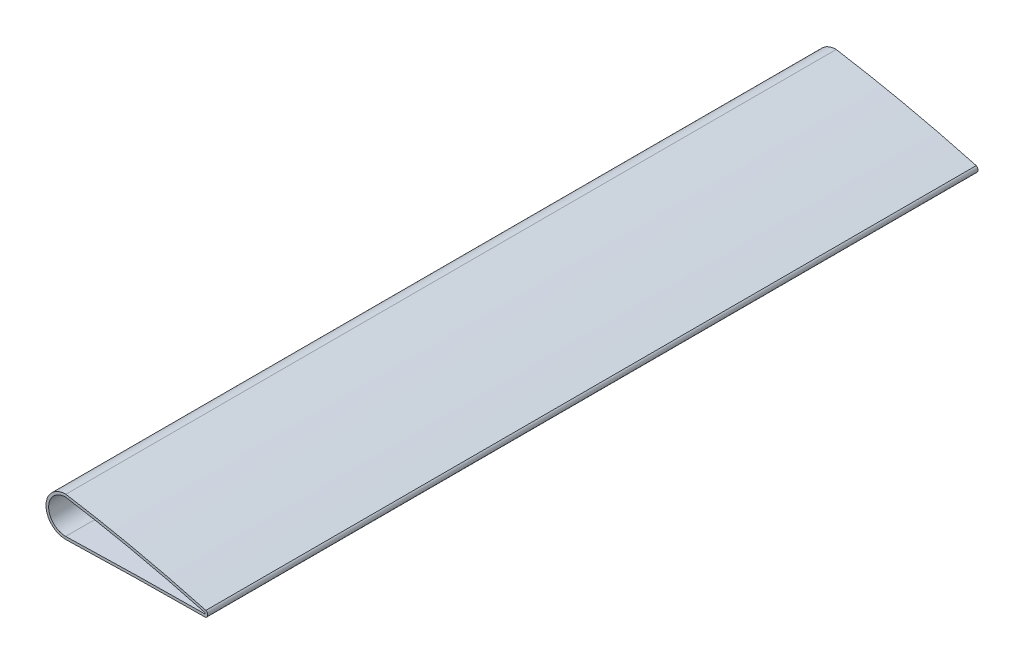
ISO-10303-21;
HEADER;
FILE_DESCRIPTION(('STEP AP214'),'2;1');
FILE_NAME('part.step','',(''),(''),'','','');
FILE_SCHEMA(('AUTOMOTIVE_DESIGN { 1 0 10303 214 1 1 1 1 }'));
ENDSEC;
DATA;
#1=APPLICATION_CONTEXT('core data for automotive mechanical design processes');
#2=APPLICATION_PROTOCOL_DEFINITION('international standard','automotive_design',2000,#1);
#3=PRODUCT_CONTEXT('',#1,'mechanical');
#4=PRODUCT('Part','Part','',(#3));
#5=PRODUCT_RELATED_PRODUCT_CATEGORY('part','',(#4));
#6=PRODUCT_DEFINITION_FORMATION('','',#4);
#7=PRODUCT_DEFINITION_CONTEXT('part definition',#1,'design');
#8=PRODUCT_DEFINITION('design','',#6,#7);
#9=PRODUCT_DEFINITION_SHAPE('','',#8);
#10=(LENGTH_UNIT() NAMED_UNIT(*) SI_UNIT(.MILLI.,.METRE.));
#11=(NAMED_UNIT(*) PLANE_ANGLE_UNIT() SI_UNIT($,.RADIAN.));
#12=(NAMED_UNIT(*) SI_UNIT($,.STERADIAN.) SOLID_ANGLE_UNIT());
#13=UNCERTAINTY_MEASURE_WITH_UNIT(LENGTH_MEASURE(1.E-05),#10,'distance_accuracy_value','');
#14=(GEOMETRIC_REPRESENTATION_CONTEXT(3) GLOBAL_UNCERTAINTY_ASSIGNED_CONTEXT((#13)) GLOBAL_UNIT_ASSIGNED_CONTEXT((#10,
#11,#12)) REPRESENTATION_CONTEXT('',''));
#15=CARTESIAN_POINT('',(0.,0.,0.));
#16=DIRECTION('',(0.,0.,1.));
#17=DIRECTION('',(1.,0.,0.));
#18=AXIS2_PLACEMENT_3D('',#15,#16,#17);
#19=CARTESIAN_POINT('',(349.559000000514,0.,94.4));
#20=DIRECTION('',(0.,0.,-1.));
#21=DIRECTION('',(-1.,0.,0.));
#22=AXIS2_PLACEMENT_3D('',#19,#20,#21);
#23=PLANE('',#22);
#24=CARTESIAN_POINT('',(349.559000000514,0.,94.4));
#25=DIRECTION('',(0.,0.,1.));
#26=DIRECTION('',(1.,0.,0.));
#27=AXIS2_PLACEMENT_3D('',#24,#25,#26);
#28=CIRCLE('',#27,2.6236681810066);
#29=CARTESIAN_POINT('',(350.530262233613,-2.43726986576836,94.4));
#30=VERTEX_POINT('',#29);
#31=CARTESIAN_POINT('',(350.855908904895,2.28071524258586,94.4));
#32=VERTEX_POINT('',#31);
#33=EDGE_CURVE('E59',#30,#32,#28,.T.);
#34=ORIENTED_EDGE('',*,*,#33,.T.);
#35=CARTESIAN_POINT('',(351.561235337821,2.08856451559935,94.4));
#36=CARTESIAN_POINT('',(347.153386989813,3.29364208516936,94.4));
#37=CARTESIAN_POINT('',(342.738080771803,4.4715372184604,94.4));
#38=CARTESIAN_POINT('',(333.892008652974,6.77121806207343,94.3999999999999));
#39=CARTESIAN_POINT('',(329.461240032593,7.89299330833642,94.3999999999999));
#40=CARTESIAN_POINT('',(320.585129860884,10.0782916493448,94.3999999999999));
#41=CARTESIAN_POINT('',(316.139787638839,11.1418120219935,94.3999999999999));
#42=CARTESIAN_POINT('',(307.235112254513,13.2090445356563,94.3999999999999));
#43=CARTESIAN_POINT('',(302.775778780824,14.2127553353927,94.3999999999999));
#44=CARTESIAN_POINT('',(293.844095732894,16.1604984932375,94.3999999999999));
#45=CARTESIAN_POINT('',(289.371746147076,17.104530798252,94.3999999999999));
#46=CARTESIAN_POINT('',(280.414885431678,18.9329765753238,94.3999999999999));
#47=CARTESIAN_POINT('',(275.930374324883,19.817390158993,94.3999999999999));
#48=CARTESIAN_POINT('',(266.950040328358,21.5266088283684,94.3999999999999));
#49=CARTESIAN_POINT('',(262.454217514532,22.3514143129553,94.3999999999999));
#50=CARTESIAN_POINT('',(253.452839668469,23.9415966446666,94.4));
#51=CARTESIAN_POINT('',(248.94728636826,24.7069832951712,94.4));
#52=CARTESIAN_POINT('',(244.436929002367,25.4428834976376,94.4));
#53=B_SPLINE_CURVE_WITH_KNOTS('',3,(#35,#36,#37,#38,#39,#40,#41,#42,#43,#44,#45,#46,#47,#48,#49,
#50,#51,#52),.UNSPECIFIED.,.F.,.F.,(4,2,2,2,2,2,2,2,4),(0.,13.70878176097,27.4201101930527,
41.1320787737527,54.8443547407376,68.5566429069025,82.268905401655,95.9810761293125,
109.690979687309),.UNSPECIFIED.);
#54=CARTESIAN_POINT('',(245.351593922481,25.2927451117739,94.4));
#55=VERTEX_POINT('',#54);
#56=EDGE_CURVE('E125',#55,#32,#53,.F.);
#57=ORIENTED_EDGE('',*,*,#56,.F.);
#58=CARTESIAN_POINT('',(245.182668181521,10.4878156214539,94.4));
#59=DIRECTION('',(0.,0.,1.));
#60=DIRECTION('',(1.,0.,0.));
#61=AXIS2_PLACEMENT_3D('',#58,#59,#60);
#62=CIRCLE('',#61,14.8058931888388);
#63=CARTESIAN_POINT('',(245.214345692163,-4.31804368000591,94.4));
#64=VERTEX_POINT('',#63);
#65=EDGE_CURVE('E114',#55,#64,#62,.T.);
#66=ORIENTED_EDGE('',*,*,#65,.T.);
#67=CARTESIAN_POINT('',(244.195914626723,-4.34918360229814,94.4));
#68=CARTESIAN_POINT('',(248.647645219321,-4.21191807234006,94.4));
#69=CARTESIAN_POINT('',(253.099616462081,-4.08251287395621,94.4));
#70=CARTESIAN_POINT('',(262.003861405222,-3.83896709888507,94.4));
#71=CARTESIAN_POINT('',(266.456135094793,-3.72482612720333,94.4));
#72=CARTESIAN_POINT('',(275.361117438612,-3.51134376667608,94.4));
#73=CARTESIAN_POINT('',(279.813826099294,-3.41200264678159,94.4));
#74=CARTESIAN_POINT('',(288.719624387708,-3.22757615612409,94.4));
#75=CARTESIAN_POINT('',(293.172714021147,-3.1424910613485,94.4));
#76=CARTESIAN_POINT('',(302.07922077344,-2.98608114327127,94.4));
#77=CARTESIAN_POINT('',(306.532637896974,-2.91475658713425,94.4));
#78=CARTESIAN_POINT('',(315.439744940457,-2.78526393408727,94.4));
#79=CARTESIAN_POINT('',(319.893434863916,-2.72709607902908,94.4));
#80=CARTESIAN_POINT('',(328.801086584318,-2.62369736407875,94.4));
#81=CARTESIAN_POINT('',(333.255048385367,-2.57846685892998,94.4));
#82=CARTESIAN_POINT('',(339.936256307118,-2.51888315301809,94.4));
#83=CARTESIAN_POINT('',(342.163467017751,-2.50039829998782,94.4));
#84=CARTESIAN_POINT('',(346.618145156643,-2.46550747742285,94.4));
#85=CARTESIAN_POINT('',(348.845612586672,-2.4491017324133,94.4));
#86=CARTESIAN_POINT('',(351.073084613621,-2.43339933048556,94.4));
#87=B_SPLINE_CURVE_WITH_KNOTS('',3,(#67,#68,#69,#70,#71,#72,#73,#74,#75,#76,#77,#78,#79,#80,#81,
#82,#83,#84,#85,#86),.UNSPECIFIED.,.F.,.F.,(4,2,2,2,2,2,2,2,2,4),(0.,13.3615295384067,
26.7227132517942,40.0841397423414,53.445824871565,66.8077693954412,80.1699595239898,
93.5325160099398,100.214377463778,106.896959885318),.UNSPECIFIED.);
#88=EDGE_CURVE('E141',#30,#64,#87,.F.);
#89=ORIENTED_EDGE('',*,*,#88,.F.);
#90=EDGE_LOOP('',(#34,#57,#66,#89));
#91=FACE_BOUND('',#90,.T.);
#92=CARTESIAN_POINT('',(349.559000000514,0.,94.4));
#93=DIRECTION('',(0.,0.,1.));
#94=DIRECTION('',(1.,0.,0.));
#95=AXIS2_PLACEMENT_3D('',#92,#93,#94);
#96=CIRCLE('',#95,0.623668181006602);
#97=CARTESIAN_POINT('',(350.000000000022,-0.441000000492787,94.4));
#98=VERTEX_POINT('',#97);
#99=CARTESIAN_POINT('',(350.000000000022,0.441000000492612,94.4));
#100=VERTEX_POINT('',#99);
#101=EDGE_CURVE('E216',#98,#100,#96,.T.);
#102=ORIENTED_EDGE('',*,*,#101,.F.);
#103=CARTESIAN_POINT('',(245.182668181521,-2.31807756738425,94.4));
#104=CARTESIAN_POINT('',(274.175597912763,-1.43157909979792,94.4));
#105=CARTESIAN_POINT('',(309.116621853552,-0.766828518135728,94.4));
#106=CARTESIAN_POINT('',(344.061048987312,-0.483347037542263,94.4));
#107=CARTESIAN_POINT('',(350.000000000022,-0.441000000492787,94.4));
#108=B_SPLINE_CURVE_WITH_KNOTS('',3,(#103,#104,#105,#106,#107),.UNSPECIFIED.,.F.,.F.,(4,1,4),
(0.,0.830047125524921,1.),.UNSPECIFIED.);
#109=CARTESIAN_POINT('',(245.182668181521,-2.31807756738504,94.4));
#110=VERTEX_POINT('',#109);
#111=EDGE_CURVE('E218',#98,#110,#108,.F.);
#112=ORIENTED_EDGE('',*,*,#111,.T.);
#113=CARTESIAN_POINT('',(245.182668181521,10.4878156214539,94.4));
#114=DIRECTION('',(0.,0.,1.));
#115=DIRECTION('',(1.,0.,0.));
#116=AXIS2_PLACEMENT_3D('',#113,#114,#115);
#117=CIRCLE('',#116,12.8058931888389);
#118=CARTESIAN_POINT('',(245.182668181521,23.2937088102936,94.4));
#119=VERTEX_POINT('',#118);
#120=EDGE_CURVE('E210',#119,#110,#117,.T.);
#121=ORIENTED_EDGE('',*,*,#120,.F.);
#122=CARTESIAN_POINT('',(350.000000000022,0.441000000492612,94.4));
#123=CARTESIAN_POINT('',(337.645527152513,3.80670533686706,94.4));
#124=CARTESIAN_POINT('',(302.963112897351,12.606844701899,94.3999999999998));
#125=CARTESIAN_POINT('',(267.850515482758,19.5728773560977,94.4));
#126=CARTESIAN_POINT('',(245.182668181521,23.2937088102936,94.4));
#127=B_SPLINE_CURVE_WITH_KNOTS('',3,(#122,#123,#124,#125,#126),.UNSPECIFIED.,.F.,.F.,(4,1,4),
(0.,0.357914643903148,1.),.UNSPECIFIED.);
#128=EDGE_CURVE('E194',#119,#100,#127,.F.);
#129=ORIENTED_EDGE('',*,*,#128,.T.);
#130=EDGE_LOOP('',(#102,#112,#121,#129));
#131=FACE_BOUND('',#130,.T.);
#132=ADVANCED_FACE('F41',(#91,#131),#23,.F.);
#133=CARTESIAN_POINT('',(245.182668181521,10.4878156214539,-486.));
#134=DIRECTION('',(0.,0.,-1.));
#135=DIRECTION('',(-1.,0.,0.));
#136=AXIS2_PLACEMENT_3D('',#133,#134,#135);
#137=PLANE('',#136);
#138=CARTESIAN_POINT('',(245.182668181521,10.4878156214539,-486.));
#139=DIRECTION('',(0.,0.,1.));
#140=DIRECTION('',(1.,0.,0.));
#141=AXIS2_PLACEMENT_3D('',#138,#139,#140);
#142=CIRCLE('',#141,14.8058931888388);
#143=CARTESIAN_POINT('',(245.351593922481,25.2927451117739,-486.));
#144=VERTEX_POINT('',#143);
#145=CARTESIAN_POINT('',(245.214345692163,-4.31804368000591,-486.));
#146=VERTEX_POINT('',#145);
#147=EDGE_CURVE('E123',#144,#146,#142,.T.);
#148=ORIENTED_EDGE('',*,*,#147,.F.);
#149=CARTESIAN_POINT('',(350.855908904879,2.28071524259025,-486.));
#150=CARTESIAN_POINT('',(346.513671654507,3.46506638490963,-486.000000000005));
#151=CARTESIAN_POINT('',(342.164162833864,4.62283810146994,-485.99999999999));
#152=CARTESIAN_POINT('',(333.450529935641,6.88363142995444,-485.999999999962));
#153=CARTESIAN_POINT('',(329.086404592904,7.98664816450083,-485.999999999949));
#154=CARTESIAN_POINT('',(320.344037232974,10.1361786267388,-485.999999999963));
#155=CARTESIAN_POINT('',(315.965794573949,11.1826897459367,-485.999999999991));
#156=CARTESIAN_POINT('',(307.195743454759,13.2176859248815,-486.000000000015));
#157=CARTESIAN_POINT('',(302.803934702598,14.2061697263566,-486.000000000012));
#158=CARTESIAN_POINT('',(294.007687853834,16.1252594643046,-486.000000000006));
#159=CARTESIAN_POINT('',(289.603249745974,17.0558653491701,-486.000000000002));
#160=CARTESIAN_POINT('',(280.782556510773,18.859235110144,-485.999999999998));
#161=CARTESIAN_POINT('',(276.366301404211,19.7319990878938,-485.999999999997));
#162=CARTESIAN_POINT('',(267.522796263069,21.4197552003528,-486.000000000003));
#163=CARTESIAN_POINT('',(263.095546298759,22.2347477033068,-486.000000000011));
#164=CARTESIAN_POINT('',(254.23096916787,23.8070103904238,-486.000000000011));
#165=CARTESIAN_POINT('',(249.793642362005,24.564282608246,-486.000000000004));
#166=CARTESIAN_POINT('',(245.35159392252,25.2927451117676,-485.999999999979));
#167=B_SPLINE_CURVE_WITH_KNOTS('',3,(#149,#150,#151,#152,#153,#154,#155,#156,#157,#158,#159,
#160,#161,#162,#163,#164,#165,#166),.UNSPECIFIED.,.F.,.F.,(4,2,2,2,2,2,2,2,4),(0.,
13.5025172458219,27.0062350972137,40.5105757946594,54.015209213877,67.5198546744461,
81.0244764036223,94.5290120444287,108.033071659712),.UNSPECIFIED.);
#168=CARTESIAN_POINT('',(350.855908904895,2.28071524258586,-486.));
#169=VERTEX_POINT('',#168);
#170=EDGE_CURVE('E132',#169,#144,#167,.T.);
#171=ORIENTED_EDGE('',*,*,#170,.F.);
#172=CARTESIAN_POINT('',(349.559000000514,0.,-486.));
#173=DIRECTION('',(0.,0.,1.));
#174=DIRECTION('',(1.,0.,0.));
#175=AXIS2_PLACEMENT_3D('',#172,#173,#174);
#176=CIRCLE('',#175,2.6236681810066);
#177=CARTESIAN_POINT('',(350.530262233613,-2.43726986576835,-486.));
#178=VERTEX_POINT('',#177);
#179=EDGE_CURVE('E103',#178,#169,#176,.T.);
#180=ORIENTED_EDGE('',*,*,#179,.F.);
#181=CARTESIAN_POINT('',(245.214345692169,-4.31804368000573,-485.999999999999));
#182=CARTESIAN_POINT('',(249.60092637438,-4.18388403923384,-486.000000000002));
#183=CARTESIAN_POINT('',(253.987739654091,-4.05739046255773,-486.000000000002));
#184=CARTESIAN_POINT('',(262.76183305619,-3.81923536364479,-485.999999999999));
#185=CARTESIAN_POINT('',(267.149113184448,-3.70757405756718,-485.999999999997));
#186=CARTESIAN_POINT('',(275.924093004157,-3.49858542743419,-485.999999999996));
#187=CARTESIAN_POINT('',(280.311792701734,-3.40125836124582,-485.999999999997));
#188=CARTESIAN_POINT('',(289.087560448035,-3.22043384888188,-485.999999999999));
#189=CARTESIAN_POINT('',(293.475628502194,-3.13693666682205,-485.999999999999));
#190=CARTESIAN_POINT('',(302.252081663114,-2.98329287898237,-485.999999999999));
#191=CARTESIAN_POINT('',(306.640466774335,-2.91314652853194,-485.999999999999));
#192=CARTESIAN_POINT('',(315.41750176415,-2.78563049789945,-485.999999999999));
#193=CARTESIAN_POINT('',(319.806151646101,-2.72826104911576,-485.999999999999));
#194=CARTESIAN_POINT('',(328.583711300291,-2.62607848350295,-486.));
#195=CARTESIAN_POINT('',(332.972621076321,-2.58126569304138,-486.));
#196=CARTESIAN_POINT('',(339.556240968054,-2.5221407091778,-486.));
#197=CARTESIAN_POINT('',(341.75091608891,-2.50378081090114,-485.999999999999));
#198=CARTESIAN_POINT('',(346.140479957763,-2.4691300535223,-485.999999999999));
#199=CARTESIAN_POINT('',(348.335368707239,-2.45283938046295,-485.999999999999));
#200=CARTESIAN_POINT('',(350.530262233608,-2.43726986576839,-485.999999999999));
#201=B_SPLINE_CURVE_WITH_KNOTS('',3,(#181,#182,#183,#184,#185,#186,#187,#188,#189,#190,#191,
#192,#193,#194,#195,#196,#197,#198,#199,#200),.UNSPECIFIED.,.F.,.F.,(4,2,2,2,2,2,2,2,2,4),(0.,
13.1658859150198,26.3319636830174,39.4982782743464,52.6648442799405,65.8316620656555,
78.9987182920027,92.1661167193836,98.7503716575694,105.335218163829),.UNSPECIFIED.);
#202=EDGE_CURVE('E12',#146,#178,#201,.T.);
#203=ORIENTED_EDGE('',*,*,#202,.F.);
#204=EDGE_LOOP('',(#148,#171,#180,#203));
#205=FACE_BOUND('',#204,.T.);
#206=CARTESIAN_POINT('',(245.182668181521,10.4878156214539,-486.));
#207=DIRECTION('',(0.,0.,1.));
#208=DIRECTION('',(1.,0.,0.));
#209=AXIS2_PLACEMENT_3D('',#206,#207,#208);
#210=CIRCLE('',#209,12.8058931888388);
#211=CARTESIAN_POINT('',(245.182668181521,23.2937088102936,-486.));
#212=VERTEX_POINT('',#211);
#213=CARTESIAN_POINT('',(245.182668181521,-2.31807756738484,-486.));
#214=VERTEX_POINT('',#213);
#215=EDGE_CURVE('E209',#212,#214,#210,.T.);
#216=ORIENTED_EDGE('',*,*,#215,.T.);
#217=CARTESIAN_POINT('',(245.182668181521,-2.31807756738425,-486.));
#218=CARTESIAN_POINT('',(274.175597912763,-1.43157909979792,-486.));
#219=CARTESIAN_POINT('',(309.116621853552,-0.766828518135728,-485.999999999998));
#220=CARTESIAN_POINT('',(344.061048987312,-0.483347037542263,-486.));
#221=CARTESIAN_POINT('',(350.000000000022,-0.441000000492787,-486.));
#222=B_SPLINE_CURVE_WITH_KNOTS('',3,(#217,#218,#219,#220,#221),.UNSPECIFIED.,.F.,.F.,(4,1,4),
(0.,0.830047125524921,1.),.UNSPECIFIED.);
#223=CARTESIAN_POINT('',(350.000000000022,-0.441000000492787,-486.));
#224=VERTEX_POINT('',#223);
#225=EDGE_CURVE('E138',#214,#224,#222,.T.);
#226=ORIENTED_EDGE('',*,*,#225,.T.);
#227=CARTESIAN_POINT('',(349.559000000514,0.,-486.));
#228=DIRECTION('',(0.,0.,1.));
#229=DIRECTION('',(1.,0.,0.));
#230=AXIS2_PLACEMENT_3D('',#227,#228,#229);
#231=CIRCLE('',#230,0.623668181006602);
#232=CARTESIAN_POINT('',(350.000000000022,0.441000000492612,-486.));
#233=VERTEX_POINT('',#232);
#234=EDGE_CURVE('E213',#224,#233,#231,.T.);
#235=ORIENTED_EDGE('',*,*,#234,.T.);
#236=CARTESIAN_POINT('',(350.000000000022,0.441000000492612,-486.));
#237=CARTESIAN_POINT('',(337.645527152513,3.80670533686706,-486.));
#238=CARTESIAN_POINT('',(302.963112897351,12.606844701899,-486.));
#239=CARTESIAN_POINT('',(267.850515482758,19.5728773560977,-486.));
#240=CARTESIAN_POINT('',(245.182668181521,23.2937088102936,-486.));
#241=B_SPLINE_CURVE_WITH_KNOTS('',3,(#236,#237,#238,#239,#240),.UNSPECIFIED.,.F.,.F.,(4,1,4),
(0.,0.357914643903148,1.),.UNSPECIFIED.);
#242=EDGE_CURVE('E187',#233,#212,#241,.T.);
#243=ORIENTED_EDGE('',*,*,#242,.T.);
#244=EDGE_LOOP('',(#216,#226,#235,#243));
#245=FACE_BOUND('',#244,.T.);
#246=ADVANCED_FACE('F155',(#205,#245),#137,.T.);
#247=CARTESIAN_POINT('',(351.035537918737,0.158890391927514,-486.));
#248=CARTESIAN_POINT('',(351.035537918737,0.158890391927514,94.4));
#249=CARTESIAN_POINT('',(350.690358612499,0.25292692811588,-486.));
#250=CARTESIAN_POINT('',(350.690358612499,0.25292692811588,94.4));
#251=CARTESIAN_POINT('',(350.34517930626,0.346963464304246,-486.));
#252=CARTESIAN_POINT('',(350.34517930626,0.346963464304246,94.4));
#253=CARTESIAN_POINT('',(337.645527152513,3.80670533686706,-486.));
#254=CARTESIAN_POINT('',(337.645527152513,3.80670533686706,94.4));
#255=CARTESIAN_POINT('',(302.963112897351,12.606844701899,-486.));
#256=CARTESIAN_POINT('',(302.963112897351,12.606844701899,94.3999999999998));
#257=CARTESIAN_POINT('',(267.850515482758,19.5728773560977,-486.));
#258=CARTESIAN_POINT('',(267.850515482758,19.5728773560977,94.4));
#259=CARTESIAN_POINT('',(244.826103037076,23.3522374737035,-486.));
#260=CARTESIAN_POINT('',(244.826103037076,23.3522374737035,94.4));
#261=CARTESIAN_POINT('',(244.469537892631,23.4107661371133,-486.));
#262=CARTESIAN_POINT('',(244.469537892631,23.4107661371133,94.4));
#263=CARTESIAN_POINT('',(244.112972748187,23.4692948005232,-486.));
#264=CARTESIAN_POINT('',(244.112972748187,23.4692948005232,94.4));
#265=B_SPLINE_SURFACE_WITH_KNOTS('',3,1,((#247,#248),(#249,#250),(#251,#252),(#253,#254),(#255,
#256),(#257,#258),(#259,#260),(#261,#262),(#263,#264)),.UNSPECIFIED.,.F.,.F.,.F.,(4,2,1,2,4),(2,
2),(-0.01,0.,0.357914643903148,1.,1.0101),(0.,1.),.UNSPECIFIED.);
#266=OFFSET_SURFACE('',#265,2.,.F.);
#267=ORIENTED_EDGE('',*,*,#170,.T.);
#268=DIRECTION('',(0.,0.,1.));
#269=VECTOR('',#268,1.);
#270=CARTESIAN_POINT('',(245.351593922481,25.2927451117739,-195.8));
#271=LINE('',#270,#269);
#272=EDGE_CURVE('E118',#144,#55,#271,.T.);
#273=ORIENTED_EDGE('',*,*,#272,.T.);
#274=ORIENTED_EDGE('',*,*,#56,.T.);
#275=DIRECTION('',(0.,0.,1.));
#276=VECTOR('',#275,1.);
#277=CARTESIAN_POINT('',(350.855908904895,2.28071524258586,-195.8));
#278=LINE('',#277,#276);
#279=EDGE_CURVE('E129',#32,#169,#278,.F.);
#280=ORIENTED_EDGE('',*,*,#279,.T.);
#281=EDGE_LOOP('',(#267,#273,#274,#280));
#282=FACE_BOUND('',#281,.T.);
#283=ADVANCED_FACE('F131',(#282),#266,.T.);
#284=CARTESIAN_POINT('',(245.182668181521,10.4878156214539,-486.));
#285=DIRECTION('',(0.,0.,1.));
#286=DIRECTION('',(1.,0.,0.));
#287=AXIS2_PLACEMENT_3D('',#284,#285,#286);
#288=CYLINDRICAL_SURFACE('',#287,14.8058931888388);
#289=DIRECTION('',(0.,0.,1.));
#290=VECTOR('',#289,1.);
#291=CARTESIAN_POINT('',(245.214345692163,-4.31804368000591,-195.8));
#292=LINE('',#291,#290);
#293=EDGE_CURVE('E120',#146,#64,#292,.T.);
#294=ORIENTED_EDGE('',*,*,#293,.T.);
#295=ORIENTED_EDGE('',*,*,#65,.F.);
#296=ORIENTED_EDGE('',*,*,#272,.F.);
#297=ORIENTED_EDGE('',*,*,#147,.T.);
#298=EDGE_LOOP('',(#294,#295,#296,#297));
#299=FACE_BOUND('',#298,.T.);
#300=ADVANCED_FACE('F116',(#299),#288,.T.);
#301=CARTESIAN_POINT('',(349.559000000514,0.,-486.));
#302=DIRECTION('',(0.,0.,1.));
#303=DIRECTION('',(1.,0.,0.));
#304=AXIS2_PLACEMENT_3D('',#301,#302,#303);
#305=CYLINDRICAL_SURFACE('',#304,2.6236681810066);
#306=ORIENTED_EDGE('',*,*,#279,.F.);
#307=ORIENTED_EDGE('',*,*,#33,.F.);
#308=DIRECTION('',(0.,0.,1.));
#309=VECTOR('',#308,1.);
#310=CARTESIAN_POINT('',(350.530262233613,-2.43726986576837,-195.8));
#311=LINE('',#310,#309);
#312=EDGE_CURVE('E50',#178,#30,#311,.T.);
#313=ORIENTED_EDGE('',*,*,#312,.F.);
#314=ORIENTED_EDGE('',*,*,#179,.T.);
#315=EDGE_LOOP('',(#306,#307,#313,#314));
#316=FACE_BOUND('',#315,.T.);
#317=ADVANCED_FACE('F268',(#316),#305,.T.);
#318=CARTESIAN_POINT('',(244.134790458449,-2.35011786149499,-486.));
#319=CARTESIAN_POINT('',(244.134790458449,-2.35011786149499,94.4));
#320=CARTESIAN_POINT('',(244.484083032806,-2.33943776345808,-486.));
#321=CARTESIAN_POINT('',(244.484083032806,-2.33943776345808,94.4));
#322=CARTESIAN_POINT('',(244.833375607164,-2.32875766542116,-486.));
#323=CARTESIAN_POINT('',(244.833375607164,-2.32875766542116,94.4));
#324=CARTESIAN_POINT('',(274.175597912763,-1.43157909979792,-486.));
#325=CARTESIAN_POINT('',(274.175597912763,-1.43157909979792,94.4));
#326=CARTESIAN_POINT('',(309.116621853552,-0.766828518135728,-485.999999999998));
#327=CARTESIAN_POINT('',(309.116621853552,-0.766828518135728,94.4));
#328=CARTESIAN_POINT('',(344.061048987312,-0.483347037542263,-486.));
#329=CARTESIAN_POINT('',(344.061048987312,-0.483347037542263,94.4));
#330=CARTESIAN_POINT('',(350.35294139871,-0.438483390664794,-486.));
#331=CARTESIAN_POINT('',(350.35294139871,-0.438483390664794,94.4));
#332=CARTESIAN_POINT('',(350.705882797399,-0.4359667808368,-486.));
#333=CARTESIAN_POINT('',(350.705882797399,-0.4359667808368,94.4));
#334=CARTESIAN_POINT('',(351.058824196087,-0.433450171008807,-486.));
#335=CARTESIAN_POINT('',(351.058824196087,-0.433450171008807,94.4));
#336=B_SPLINE_SURFACE_WITH_KNOTS('',3,1,((#318,#319),(#320,#321),(#322,#323),(#324,#325),(#326,
#327),(#328,#329),(#330,#331),(#332,#333),(#334,#335)),.UNSPECIFIED.,.F.,.F.,.F.,(4,2,1,2,4),(2,
2),(-0.01,0.,0.830047125524921,1.,1.0101),(0.,1.),.UNSPECIFIED.);
#337=OFFSET_SURFACE('',#336,2.,.F.);
#338=ORIENTED_EDGE('',*,*,#202,.T.);
#339=ORIENTED_EDGE('',*,*,#312,.T.);
#340=ORIENTED_EDGE('',*,*,#88,.T.);
#341=ORIENTED_EDGE('',*,*,#293,.F.);
#342=EDGE_LOOP('',(#338,#339,#340,#341));
#343=FACE_BOUND('',#342,.T.);
#344=ADVANCED_FACE('F159',(#343),#337,.T.);
#345=CARTESIAN_POINT('',(350.000000000022,0.441000000492612,-486.));
#346=CARTESIAN_POINT('',(350.000000000022,0.441000000492612,94.4));
#347=CARTESIAN_POINT('',(337.645527152513,3.80670533686706,-486.));
#348=CARTESIAN_POINT('',(337.645527152513,3.80670533686706,94.4));
#349=CARTESIAN_POINT('',(302.963112897351,12.606844701899,-486.));
#350=CARTESIAN_POINT('',(302.963112897351,12.606844701899,94.3999999999998));
#351=CARTESIAN_POINT('',(267.850515482758,19.5728773560977,-486.));
#352=CARTESIAN_POINT('',(267.850515482758,19.5728773560977,94.4));
#353=CARTESIAN_POINT('',(245.182668181521,23.2937088102936,-486.));
#354=CARTESIAN_POINT('',(245.182668181521,23.2937088102936,94.4));
#355=B_SPLINE_SURFACE_WITH_KNOTS('',3,1,((#345,#346),(#347,#348),(#349,#350),(#351,#352),(#353,
#354)),.UNSPECIFIED.,.F.,.F.,.F.,(4,1,4),(2,2),(0.,0.357914643903148,1.),(0.,1.),.UNSPECIFIED.);
#356=DIRECTION('',(0.,0.,-1.));
#357=VECTOR('',#356,1.);
#358=CARTESIAN_POINT('',(350.000000000022,0.441000000492612,-195.8));
#359=LINE('',#358,#357);
#360=EDGE_CURVE('E202',#100,#233,#359,.T.);
#361=DIRECTION('',(0.,0.,1.));
#362=VECTOR('',#361,1.);
#363=CARTESIAN_POINT('',(245.182668181521,23.2937088102936,-195.8));
#364=LINE('',#363,#362);
#365=EDGE_CURVE('E193',#212,#119,#364,.T.);
#366=ORIENTED_EDGE('',*,*,#242,.F.);
#367=ORIENTED_EDGE('',*,*,#360,.F.);
#368=ORIENTED_EDGE('',*,*,#128,.F.);
#369=ORIENTED_EDGE('',*,*,#365,.F.);
#370=EDGE_LOOP('',(#366,#367,#368,#369));
#371=FACE_BOUND('',#370,.T.);
#372=ADVANCED_FACE('F241',(#371),#355,.F.);
#373=CARTESIAN_POINT('',(245.182668181521,10.4878156214539,-486.));
#374=DIRECTION('',(0.,0.,1.));
#375=DIRECTION('',(1.,0.,0.));
#376=AXIS2_PLACEMENT_3D('',#373,#374,#375);
#377=CYLINDRICAL_SURFACE('',#376,12.8058931888388);
#378=DIRECTION('',(0.,0.,1.));
#379=VECTOR('',#378,1.);
#380=CARTESIAN_POINT('',(245.182668181521,-2.31807756738484,-486.));
#381=LINE('',#380,#379);
#382=EDGE_CURVE('E192',#214,#110,#381,.T.);
#383=ORIENTED_EDGE('',*,*,#382,.F.);
#384=ORIENTED_EDGE('',*,*,#215,.F.);
#385=ORIENTED_EDGE('',*,*,#365,.T.);
#386=ORIENTED_EDGE('',*,*,#120,.T.);
#387=EDGE_LOOP('',(#383,#384,#385,#386));
#388=FACE_BOUND('',#387,.T.);
#389=ADVANCED_FACE('F237',(#388),#377,.F.);
#390=CARTESIAN_POINT('',(349.559000000514,0.,-486.));
#391=DIRECTION('',(0.,0.,1.));
#392=DIRECTION('',(1.,0.,0.));
#393=AXIS2_PLACEMENT_3D('',#390,#391,#392);
#394=CYLINDRICAL_SURFACE('',#393,0.623668181006602);
#395=ORIENTED_EDGE('',*,*,#360,.T.);
#396=ORIENTED_EDGE('',*,*,#234,.F.);
#397=DIRECTION('',(0.,0.,1.));
#398=VECTOR('',#397,1.);
#399=CARTESIAN_POINT('',(350.000000000022,-0.441000000492787,-195.8));
#400=LINE('',#399,#398);
#401=EDGE_CURVE('E44',#224,#98,#400,.T.);
#402=ORIENTED_EDGE('',*,*,#401,.T.);
#403=ORIENTED_EDGE('',*,*,#101,.T.);
#404=EDGE_LOOP('',(#395,#396,#402,#403));
#405=FACE_BOUND('',#404,.T.);
#406=ADVANCED_FACE('F242',(#405),#394,.F.);
#407=CARTESIAN_POINT('',(245.182668181521,-2.31807756738425,-486.));
#408=CARTESIAN_POINT('',(245.182668181521,-2.31807756738425,94.4));
#409=CARTESIAN_POINT('',(274.175597912763,-1.43157909979792,-486.));
#410=CARTESIAN_POINT('',(274.175597912763,-1.43157909979792,94.4));
#411=CARTESIAN_POINT('',(309.116621853552,-0.766828518135728,-485.999999999998));
#412=CARTESIAN_POINT('',(309.116621853552,-0.766828518135728,94.4));
#413=CARTESIAN_POINT('',(344.061048987312,-0.483347037542263,-486.));
#414=CARTESIAN_POINT('',(344.061048987312,-0.483347037542263,94.4));
#415=CARTESIAN_POINT('',(350.000000000022,-0.441000000492787,-486.));
#416=CARTESIAN_POINT('',(350.000000000022,-0.441000000492787,94.4));
#417=B_SPLINE_SURFACE_WITH_KNOTS('',3,1,((#407,#408),(#409,#410),(#411,#412),(#413,#414),(#415,
#416)),.UNSPECIFIED.,.F.,.F.,.F.,(4,1,4),(2,2),(0.,0.830047125524921,1.),(0.,1.),.UNSPECIFIED.);
#418=ORIENTED_EDGE('',*,*,#225,.F.);
#419=ORIENTED_EDGE('',*,*,#382,.T.);
#420=ORIENTED_EDGE('',*,*,#111,.F.);
#421=ORIENTED_EDGE('',*,*,#401,.F.);
#422=EDGE_LOOP('',(#418,#419,#420,#421));
#423=FACE_BOUND('',#422,.T.);
#424=ADVANCED_FACE('F234',(#423),#417,.F.);
#425=CLOSED_SHELL('',(#132,#246,#283,#300,#317,#344,#372,#389,#406,#424));
#426=MANIFOLD_SOLID_BREP('B2',#425);
#427=ADVANCED_BREP_SHAPE_REPRESENTATION('',(#18,#426),#14);
#428=SHAPE_DEFINITION_REPRESENTATION(#9,#427);
ENDSEC;
END-ISO-10303-21;
